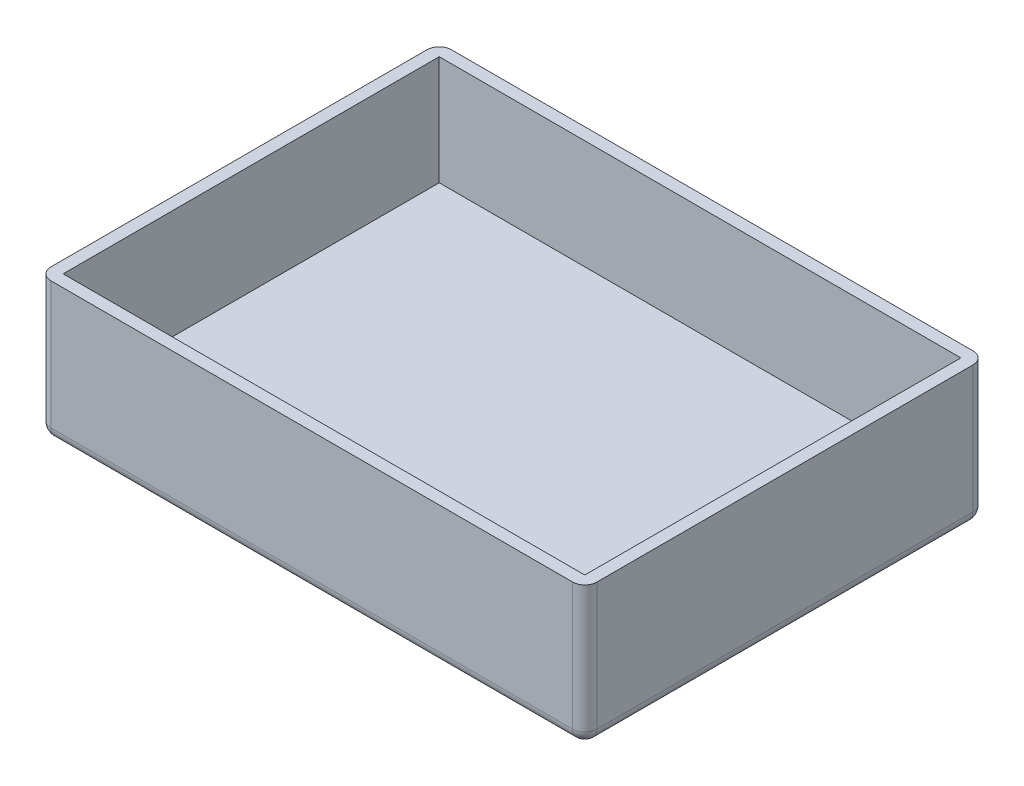
ISO-10303-21;
HEADER;
FILE_DESCRIPTION(('STEP AP214'),'2;1');
FILE_NAME('part.step','',(''),(''),'','','');
FILE_SCHEMA(('AUTOMOTIVE_DESIGN { 1 0 10303 214 1 1 1 1 }'));
ENDSEC;
DATA;
#1=APPLICATION_CONTEXT('core data for automotive mechanical design processes');
#2=APPLICATION_PROTOCOL_DEFINITION('international standard','automotive_design',2000,#1);
#3=PRODUCT_CONTEXT('',#1,'mechanical');
#4=PRODUCT('Part','Part','',(#3));
#5=PRODUCT_RELATED_PRODUCT_CATEGORY('part','',(#4));
#6=PRODUCT_DEFINITION_FORMATION('','',#4);
#7=PRODUCT_DEFINITION_CONTEXT('part definition',#1,'design');
#8=PRODUCT_DEFINITION('design','',#6,#7);
#9=PRODUCT_DEFINITION_SHAPE('','',#8);
#10=(LENGTH_UNIT() NAMED_UNIT(*) SI_UNIT(.MILLI.,.METRE.));
#11=(NAMED_UNIT(*) PLANE_ANGLE_UNIT() SI_UNIT($,.RADIAN.));
#12=(NAMED_UNIT(*) SI_UNIT($,.STERADIAN.) SOLID_ANGLE_UNIT());
#13=UNCERTAINTY_MEASURE_WITH_UNIT(LENGTH_MEASURE(1.E-05),#10,'distance_accuracy_value','');
#14=(GEOMETRIC_REPRESENTATION_CONTEXT(3) GLOBAL_UNCERTAINTY_ASSIGNED_CONTEXT((#13)) GLOBAL_UNIT_ASSIGNED_CONTEXT((#10,
#11,#12)) REPRESENTATION_CONTEXT('',''));
#15=CARTESIAN_POINT('',(0.,0.,0.));
#16=DIRECTION('',(0.,0.,1.));
#17=DIRECTION('',(1.,0.,0.));
#18=AXIS2_PLACEMENT_3D('',#15,#16,#17);
#19=CARTESIAN_POINT('',(-62.8276420970337,115.,33.434414562862));
#20=DIRECTION('',(1.,0.,0.));
#21=DIRECTION('',(0.,0.,-1.));
#22=AXIS2_PLACEMENT_3D('',#19,#20,#21);
#23=PLANE('',#22);
#24=DIRECTION('',(0.,0.,1.));
#25=VECTOR('',#24,1.);
#26=CARTESIAN_POINT('',(-62.8276420970337,9.99999999999999,33.434414562862));
#27=LINE('',#26,#25);
#28=CARTESIAN_POINT('',(-62.8276420970337,9.99999999999999,-286.565585437138));
#29=VERTEX_POINT('',#28);
#30=CARTESIAN_POINT('',(-62.8276420970337,9.99999999999999,23.434414562862));
#31=VERTEX_POINT('',#30);
#32=EDGE_CURVE('E50',#29,#31,#27,.T.);
#33=ORIENTED_EDGE('',*,*,#32,.T.);
#34=DIRECTION('',(0.,-1.,0.));
#35=VECTOR('',#34,1.);
#36=CARTESIAN_POINT('',(-62.8276420970337,115.,23.434414562862));
#37=LINE('',#36,#35);
#38=CARTESIAN_POINT('',(-62.8276420970337,115.,23.434414562862));
#39=VERTEX_POINT('',#38);
#40=EDGE_CURVE('E219',#31,#39,#37,.F.);
#41=ORIENTED_EDGE('',*,*,#40,.T.);
#42=DIRECTION('',(0.,0.,1.));
#43=VECTOR('',#42,1.);
#44=CARTESIAN_POINT('',(-62.8276420970337,115.,33.434414562862));
#45=LINE('',#44,#43);
#46=CARTESIAN_POINT('',(-62.8276420970337,115.,-286.565585437138));
#47=VERTEX_POINT('',#46);
#48=EDGE_CURVE('E174',#47,#39,#45,.T.);
#49=ORIENTED_EDGE('',*,*,#48,.F.);
#50=DIRECTION('',(0.,-1.,0.));
#51=VECTOR('',#50,1.);
#52=CARTESIAN_POINT('',(-62.8276420970337,115.,-286.565585437138));
#53=LINE('',#52,#51);
#54=EDGE_CURVE('E55',#47,#29,#53,.T.);
#55=ORIENTED_EDGE('',*,*,#54,.T.);
#56=EDGE_LOOP('',(#33,#41,#49,#55));
#57=FACE_BOUND('',#56,.T.);
#58=ADVANCED_FACE('F33',(#57),#23,.F.);
#59=CARTESIAN_POINT('',(-62.8276420970337,115.,33.434414562862));
#60=DIRECTION('',(0.,0.,-1.));
#61=DIRECTION('',(-1.,0.,0.));
#62=AXIS2_PLACEMENT_3D('',#59,#60,#61);
#63=PLANE('',#62);
#64=DIRECTION('',(1.,0.,0.));
#65=VECTOR('',#64,1.);
#66=CARTESIAN_POINT('',(-62.8276420970337,115.,33.434414562862));
#67=LINE('',#66,#65);
#68=CARTESIAN_POINT('',(-52.8276420970337,115.,33.434414562862));
#69=VERTEX_POINT('',#68);
#70=CARTESIAN_POINT('',(377.172357902966,115.,33.434414562862));
#71=VERTEX_POINT('',#70);
#72=EDGE_CURVE('E180',#69,#71,#67,.T.);
#73=ORIENTED_EDGE('',*,*,#72,.F.);
#74=DIRECTION('',(0.,-1.,0.));
#75=VECTOR('',#74,1.);
#76=CARTESIAN_POINT('',(-52.8276420970337,115.,33.434414562862));
#77=LINE('',#76,#75);
#78=CARTESIAN_POINT('',(-52.8276420970337,9.99999999999999,33.434414562862));
#79=VERTEX_POINT('',#78);
#80=EDGE_CURVE('E194',#69,#79,#77,.T.);
#81=ORIENTED_EDGE('',*,*,#80,.T.);
#82=DIRECTION('',(1.,0.,0.));
#83=VECTOR('',#82,1.);
#84=CARTESIAN_POINT('',(387.172357902966,9.99999999999999,33.434414562862));
#85=LINE('',#84,#83);
#86=CARTESIAN_POINT('',(377.172357902966,9.99999999999999,33.434414562862));
#87=VERTEX_POINT('',#86);
#88=EDGE_CURVE('E191',#79,#87,#85,.T.);
#89=ORIENTED_EDGE('',*,*,#88,.T.);
#90=DIRECTION('',(0.,-1.,0.));
#91=VECTOR('',#90,1.);
#92=CARTESIAN_POINT('',(377.172357902966,115.,33.434414562862));
#93=LINE('',#92,#91);
#94=EDGE_CURVE('E189',#87,#71,#93,.F.);
#95=ORIENTED_EDGE('',*,*,#94,.T.);
#96=EDGE_LOOP('',(#73,#81,#89,#95));
#97=FACE_BOUND('',#96,.T.);
#98=ADVANCED_FACE('F316',(#97),#63,.F.);
#99=CARTESIAN_POINT('',(387.172357902966,115.,33.434414562862));
#100=DIRECTION('',(-1.,0.,0.));
#101=DIRECTION('',(0.,0.,1.));
#102=AXIS2_PLACEMENT_3D('',#99,#100,#101);
#103=PLANE('',#102);
#104=DIRECTION('',(0.,0.,-1.));
#105=VECTOR('',#104,1.);
#106=CARTESIAN_POINT('',(387.172357902966,9.99999999999999,-296.565585437138));
#107=LINE('',#106,#105);
#108=CARTESIAN_POINT('',(387.172357902966,9.99999999999999,23.434414562862));
#109=VERTEX_POINT('',#108);
#110=CARTESIAN_POINT('',(387.172357902966,9.99999999999999,-286.565585437138));
#111=VERTEX_POINT('',#110);
#112=EDGE_CURVE('E207',#109,#111,#107,.T.);
#113=ORIENTED_EDGE('',*,*,#112,.T.);
#114=DIRECTION('',(0.,-1.,0.));
#115=VECTOR('',#114,1.);
#116=CARTESIAN_POINT('',(387.172357902966,115.,-286.565585437138));
#117=LINE('',#116,#115);
#118=CARTESIAN_POINT('',(387.172357902966,115.,-286.565585437138));
#119=VERTEX_POINT('',#118);
#120=EDGE_CURVE('E209',#111,#119,#117,.F.);
#121=ORIENTED_EDGE('',*,*,#120,.T.);
#122=DIRECTION('',(0.,0.,-1.));
#123=VECTOR('',#122,1.);
#124=CARTESIAN_POINT('',(387.172357902966,115.,33.434414562862));
#125=LINE('',#124,#123);
#126=CARTESIAN_POINT('',(387.172357902966,115.,23.434414562862));
#127=VERTEX_POINT('',#126);
#128=EDGE_CURVE('E183',#127,#119,#125,.T.);
#129=ORIENTED_EDGE('',*,*,#128,.F.);
#130=DIRECTION('',(0.,-1.,0.));
#131=VECTOR('',#130,1.);
#132=CARTESIAN_POINT('',(387.172357902966,115.,23.434414562862));
#133=LINE('',#132,#131);
#134=EDGE_CURVE('E205',#127,#109,#133,.T.);
#135=ORIENTED_EDGE('',*,*,#134,.T.);
#136=EDGE_LOOP('',(#113,#121,#129,#135));
#137=FACE_BOUND('',#136,.T.);
#138=ADVANCED_FACE('F319',(#137),#103,.F.);
#139=CARTESIAN_POINT('',(-62.8276420970337,115.,-296.565585437138));
#140=DIRECTION('',(0.,0.,1.));
#141=DIRECTION('',(1.,0.,0.));
#142=AXIS2_PLACEMENT_3D('',#139,#140,#141);
#143=PLANE('',#142);
#144=DIRECTION('',(-1.,0.,0.));
#145=VECTOR('',#144,1.);
#146=CARTESIAN_POINT('',(-62.8276420970337,9.99999999999999,-296.565585437138));
#147=LINE('',#146,#145);
#148=CARTESIAN_POINT('',(377.172357902966,9.99999999999999,-296.565585437138));
#149=VERTEX_POINT('',#148);
#150=CARTESIAN_POINT('',(-52.8276420970337,9.99999999999999,-296.565585437138));
#151=VERTEX_POINT('',#150);
#152=EDGE_CURVE('E213',#149,#151,#147,.T.);
#153=ORIENTED_EDGE('',*,*,#152,.T.);
#154=DIRECTION('',(0.,-1.,0.));
#155=VECTOR('',#154,1.);
#156=CARTESIAN_POINT('',(-52.8276420970337,115.,-296.565585437138));
#157=LINE('',#156,#155);
#158=CARTESIAN_POINT('',(-52.8276420970337,115.,-296.565585437138));
#159=VERTEX_POINT('',#158);
#160=EDGE_CURVE('E215',#151,#159,#157,.F.);
#161=ORIENTED_EDGE('',*,*,#160,.T.);
#162=DIRECTION('',(-1.,0.,0.));
#163=VECTOR('',#162,1.);
#164=CARTESIAN_POINT('',(-62.8276420970337,115.,-296.565585437138));
#165=LINE('',#164,#163);
#166=CARTESIAN_POINT('',(377.172357902966,115.,-296.565585437138));
#167=VERTEX_POINT('',#166);
#168=EDGE_CURVE('E186',#167,#159,#165,.T.);
#169=ORIENTED_EDGE('',*,*,#168,.F.);
#170=DIRECTION('',(0.,-1.,0.));
#171=VECTOR('',#170,1.);
#172=CARTESIAN_POINT('',(377.172357902966,115.,-296.565585437138));
#173=LINE('',#172,#171);
#174=EDGE_CURVE('E211',#167,#149,#173,.T.);
#175=ORIENTED_EDGE('',*,*,#174,.T.);
#176=EDGE_LOOP('',(#153,#161,#169,#175));
#177=FACE_BOUND('',#176,.T.);
#178=ADVANCED_FACE('F284',(#177),#143,.F.);
#179=CARTESIAN_POINT('',(0.,115.,0.));
#180=DIRECTION('',(0.,-1.,0.));
#181=DIRECTION('',(0.,0.,-1.));
#182=AXIS2_PLACEMENT_3D('',#179,#180,#181);
#183=PLANE('',#182);
#184=DIRECTION('',(1.,0.,0.));
#185=VECTOR('',#184,1.);
#186=CARTESIAN_POINT('',(-52.8276420970337,115.,23.434414562862));
#187=LINE('',#186,#185);
#188=CARTESIAN_POINT('',(-52.8276420970337,115.,23.434414562862));
#189=VERTEX_POINT('',#188);
#190=CARTESIAN_POINT('',(377.172357902966,115.,23.434414562862));
#191=VERTEX_POINT('',#190);
#192=EDGE_CURVE('E168',#189,#191,#187,.T.);
#193=ORIENTED_EDGE('',*,*,#192,.F.);
#194=DIRECTION('',(0.,0.,1.));
#195=VECTOR('',#194,1.);
#196=CARTESIAN_POINT('',(-52.8276420970337,115.,-286.565585437138));
#197=LINE('',#196,#195);
#198=CARTESIAN_POINT('',(-52.8276420970337,115.,-286.565585437138));
#199=VERTEX_POINT('',#198);
#200=EDGE_CURVE('E142',#199,#189,#197,.T.);
#201=ORIENTED_EDGE('',*,*,#200,.F.);
#202=DIRECTION('',(-1.,0.,0.));
#203=VECTOR('',#202,1.);
#204=CARTESIAN_POINT('',(-52.8276420970337,115.,-286.565585437138));
#205=LINE('',#204,#203);
#206=CARTESIAN_POINT('',(377.172357902966,115.,-286.565585437138));
#207=VERTEX_POINT('',#206);
#208=EDGE_CURVE('E159',#207,#199,#205,.T.);
#209=ORIENTED_EDGE('',*,*,#208,.F.);
#210=DIRECTION('',(0.,0.,-1.));
#211=VECTOR('',#210,1.);
#212=CARTESIAN_POINT('',(377.172357902966,115.,-286.565585437138));
#213=LINE('',#212,#211);
#214=EDGE_CURVE('E162',#191,#207,#213,.T.);
#215=ORIENTED_EDGE('',*,*,#214,.F.);
#216=EDGE_LOOP('',(#193,#201,#209,#215));
#217=FACE_BOUND('',#216,.T.);
#218=ORIENTED_EDGE('',*,*,#48,.T.);
#219=CARTESIAN_POINT('',(-52.8276420970337,115.,23.434414562862));
#220=DIRECTION('',(0.,-1.,0.));
#221=DIRECTION('',(0.,0.,-1.));
#222=AXIS2_PLACEMENT_3D('',#219,#220,#221);
#223=CIRCLE('',#222,10.);
#224=EDGE_CURVE('E11',#39,#69,#223,.F.);
#225=ORIENTED_EDGE('',*,*,#224,.T.);
#226=ORIENTED_EDGE('',*,*,#72,.T.);
#227=CARTESIAN_POINT('',(377.172357902966,115.,23.434414562862));
#228=DIRECTION('',(0.,-1.,0.));
#229=DIRECTION('',(0.,0.,-1.));
#230=AXIS2_PLACEMENT_3D('',#227,#228,#229);
#231=CIRCLE('',#230,10.);
#232=EDGE_CURVE('E221',#71,#127,#231,.F.);
#233=ORIENTED_EDGE('',*,*,#232,.T.);
#234=ORIENTED_EDGE('',*,*,#128,.T.);
#235=CARTESIAN_POINT('',(377.172357902966,115.,-286.565585437138));
#236=DIRECTION('',(0.,-1.,0.));
#237=DIRECTION('',(0.,0.,-1.));
#238=AXIS2_PLACEMENT_3D('',#235,#236,#237);
#239=CIRCLE('',#238,10.);
#240=EDGE_CURVE('E223',#119,#167,#239,.F.);
#241=ORIENTED_EDGE('',*,*,#240,.T.);
#242=ORIENTED_EDGE('',*,*,#168,.T.);
#243=CARTESIAN_POINT('',(-52.8276420970337,115.,-286.565585437138));
#244=DIRECTION('',(0.,-1.,0.));
#245=DIRECTION('',(0.,0.,-1.));
#246=AXIS2_PLACEMENT_3D('',#243,#244,#245);
#247=CIRCLE('',#246,10.);
#248=EDGE_CURVE('E42',#159,#47,#247,.F.);
#249=ORIENTED_EDGE('',*,*,#248,.T.);
#250=EDGE_LOOP('',(#218,#225,#226,#233,#234,#241,#242,#249));
#251=FACE_BOUND('',#250,.T.);
#252=ADVANCED_FACE('F277',(#217,#251),#183,.F.);
#253=CARTESIAN_POINT('',(0.,0.,0.));
#254=DIRECTION('',(0.,-1.,0.));
#255=DIRECTION('',(0.,0.,-1.));
#256=AXIS2_PLACEMENT_3D('',#253,#254,#255);
#257=PLANE('',#256);
#258=DIRECTION('',(0.,0.,-1.));
#259=VECTOR('',#258,1.);
#260=CARTESIAN_POINT('',(377.172357902966,0.,33.434414562862));
#261=LINE('',#260,#259);
#262=CARTESIAN_POINT('',(377.172357902966,0.,-286.565585437138));
#263=VERTEX_POINT('',#262);
#264=CARTESIAN_POINT('',(377.172357902966,0.,23.434414562862));
#265=VERTEX_POINT('',#264);
#266=EDGE_CURVE('E200',#263,#265,#261,.F.);
#267=ORIENTED_EDGE('',*,*,#266,.T.);
#268=DIRECTION('',(1.,0.,0.));
#269=VECTOR('',#268,1.);
#270=CARTESIAN_POINT('',(-62.8276420970337,0.,23.434414562862));
#271=LINE('',#270,#269);
#272=CARTESIAN_POINT('',(-52.8276420970337,0.,23.434414562862));
#273=VERTEX_POINT('',#272);
#274=EDGE_CURVE('E202',#265,#273,#271,.F.);
#275=ORIENTED_EDGE('',*,*,#274,.T.);
#276=DIRECTION('',(0.,0.,1.));
#277=VECTOR('',#276,1.);
#278=CARTESIAN_POINT('',(-52.8276420970337,0.,-296.565585437138));
#279=LINE('',#278,#277);
#280=CARTESIAN_POINT('',(-52.8276420970337,0.,-286.565585437138));
#281=VERTEX_POINT('',#280);
#282=EDGE_CURVE('E196',#273,#281,#279,.F.);
#283=ORIENTED_EDGE('',*,*,#282,.T.);
#284=DIRECTION('',(-1.,0.,0.));
#285=VECTOR('',#284,1.);
#286=CARTESIAN_POINT('',(387.172357902966,0.,-286.565585437138));
#287=LINE('',#286,#285);
#288=EDGE_CURVE('E198',#281,#263,#287,.F.);
#289=ORIENTED_EDGE('',*,*,#288,.T.);
#290=EDGE_LOOP('',(#267,#275,#283,#289));
#291=FACE_BOUND('',#290,.T.);
#292=ADVANCED_FACE('F303',(#291),#257,.T.);
#293=CARTESIAN_POINT('',(-52.8276420970337,25.,-286.565585437138));
#294=DIRECTION('',(-1.,0.,0.));
#295=DIRECTION('',(0.,0.,1.));
#296=AXIS2_PLACEMENT_3D('',#293,#294,#295);
#297=PLANE('',#296);
#298=ORIENTED_EDGE('',*,*,#200,.T.);
#299=DIRECTION('',(0.,1.,0.));
#300=VECTOR('',#299,1.);
#301=CARTESIAN_POINT('',(-52.8276420970337,25.,23.434414562862));
#302=LINE('',#301,#300);
#303=CARTESIAN_POINT('',(-52.8276420970337,25.,23.434414562862));
#304=VERTEX_POINT('',#303);
#305=EDGE_CURVE('E135',#304,#189,#302,.T.);
#306=ORIENTED_EDGE('',*,*,#305,.F.);
#307=DIRECTION('',(0.,0.,1.));
#308=VECTOR('',#307,1.);
#309=CARTESIAN_POINT('',(-52.8276420970337,25.,-286.565585437138));
#310=LINE('',#309,#308);
#311=CARTESIAN_POINT('',(-52.8276420970337,25.,-286.565585437138));
#312=VERTEX_POINT('',#311);
#313=EDGE_CURVE('E139',#312,#304,#310,.T.);
#314=ORIENTED_EDGE('',*,*,#313,.F.);
#315=DIRECTION('',(0.,1.,0.));
#316=VECTOR('',#315,1.);
#317=CARTESIAN_POINT('',(-52.8276420970337,25.,-286.565585437138));
#318=LINE('',#317,#316);
#319=EDGE_CURVE('E172',#312,#199,#318,.T.);
#320=ORIENTED_EDGE('',*,*,#319,.T.);
#321=EDGE_LOOP('',(#298,#306,#314,#320));
#322=FACE_BOUND('',#321,.T.);
#323=ADVANCED_FACE('F137',(#322),#297,.F.);
#324=CARTESIAN_POINT('',(-52.8276420970337,25.,-286.565585437138));
#325=DIRECTION('',(0.,0.,-1.));
#326=DIRECTION('',(-1.,0.,0.));
#327=AXIS2_PLACEMENT_3D('',#324,#325,#326);
#328=PLANE('',#327);
#329=ORIENTED_EDGE('',*,*,#208,.T.);
#330=ORIENTED_EDGE('',*,*,#319,.F.);
#331=DIRECTION('',(-1.,0.,0.));
#332=VECTOR('',#331,1.);
#333=CARTESIAN_POINT('',(-52.8276420970337,25.,-286.565585437138));
#334=LINE('',#333,#332);
#335=CARTESIAN_POINT('',(377.172357902966,25.,-286.565585437138));
#336=VERTEX_POINT('',#335);
#337=EDGE_CURVE('E147',#336,#312,#334,.T.);
#338=ORIENTED_EDGE('',*,*,#337,.F.);
#339=DIRECTION('',(0.,1.,0.));
#340=VECTOR('',#339,1.);
#341=CARTESIAN_POINT('',(377.172357902966,25.,-286.565585437138));
#342=LINE('',#341,#340);
#343=EDGE_CURVE('E175',#336,#207,#342,.T.);
#344=ORIENTED_EDGE('',*,*,#343,.T.);
#345=EDGE_LOOP('',(#329,#330,#338,#344));
#346=FACE_BOUND('',#345,.T.);
#347=ADVANCED_FACE('F366',(#346),#328,.F.);
#348=CARTESIAN_POINT('',(377.172357902966,25.,-286.565585437138));
#349=DIRECTION('',(1.,0.,0.));
#350=DIRECTION('',(0.,0.,-1.));
#351=AXIS2_PLACEMENT_3D('',#348,#349,#350);
#352=PLANE('',#351);
#353=ORIENTED_EDGE('',*,*,#214,.T.);
#354=ORIENTED_EDGE('',*,*,#343,.F.);
#355=DIRECTION('',(0.,0.,-1.));
#356=VECTOR('',#355,1.);
#357=CARTESIAN_POINT('',(377.172357902966,25.,-286.565585437138));
#358=LINE('',#357,#356);
#359=CARTESIAN_POINT('',(377.172357902966,25.,23.434414562862));
#360=VERTEX_POINT('',#359);
#361=EDGE_CURVE('E155',#360,#336,#358,.T.);
#362=ORIENTED_EDGE('',*,*,#361,.F.);
#363=DIRECTION('',(0.,1.,0.));
#364=VECTOR('',#363,1.);
#365=CARTESIAN_POINT('',(377.172357902966,25.,23.434414562862));
#366=LINE('',#365,#364);
#367=EDGE_CURVE('E146',#360,#191,#366,.T.);
#368=ORIENTED_EDGE('',*,*,#367,.T.);
#369=EDGE_LOOP('',(#353,#354,#362,#368));
#370=FACE_BOUND('',#369,.T.);
#371=ADVANCED_FACE('F363',(#370),#352,.F.);
#372=CARTESIAN_POINT('',(-52.8276420970337,25.,23.434414562862));
#373=DIRECTION('',(0.,0.,1.));
#374=DIRECTION('',(1.,0.,0.));
#375=AXIS2_PLACEMENT_3D('',#372,#373,#374);
#376=PLANE('',#375);
#377=ORIENTED_EDGE('',*,*,#192,.T.);
#378=ORIENTED_EDGE('',*,*,#367,.F.);
#379=DIRECTION('',(1.,0.,0.));
#380=VECTOR('',#379,1.);
#381=CARTESIAN_POINT('',(-52.8276420970337,25.,23.434414562862));
#382=LINE('',#381,#380);
#383=EDGE_CURVE('E150',#304,#360,#382,.T.);
#384=ORIENTED_EDGE('',*,*,#383,.F.);
#385=ORIENTED_EDGE('',*,*,#305,.T.);
#386=EDGE_LOOP('',(#377,#378,#384,#385));
#387=FACE_BOUND('',#386,.T.);
#388=ADVANCED_FACE('F151',(#387),#376,.F.);
#389=CARTESIAN_POINT('',(0.,25.,0.));
#390=DIRECTION('',(0.,1.,0.));
#391=DIRECTION('',(0.,0.,1.));
#392=AXIS2_PLACEMENT_3D('',#389,#390,#391);
#393=PLANE('',#392);
#394=ORIENTED_EDGE('',*,*,#313,.T.);
#395=ORIENTED_EDGE('',*,*,#383,.T.);
#396=ORIENTED_EDGE('',*,*,#361,.T.);
#397=ORIENTED_EDGE('',*,*,#337,.T.);
#398=EDGE_LOOP('',(#394,#395,#396,#397));
#399=FACE_BOUND('',#398,.T.);
#400=ADVANCED_FACE('F157',(#399),#393,.T.);
#401=CARTESIAN_POINT('',(-52.8276420970337,115.,-286.565585437138));
#402=DIRECTION('',(0.,-1.,0.));
#403=DIRECTION('',(0.,0.,-1.));
#404=AXIS2_PLACEMENT_3D('',#401,#402,#403);
#405=CYLINDRICAL_SURFACE('',#404,10.);
#406=ORIENTED_EDGE('',*,*,#248,.F.);
#407=ORIENTED_EDGE('',*,*,#160,.F.);
#408=CARTESIAN_POINT('',(-52.8276420970337,9.99999999999999,-286.565585437138));
#409=DIRECTION('',(0.,-1.,0.));
#410=DIRECTION('',(0.,0.,-1.));
#411=AXIS2_PLACEMENT_3D('',#408,#409,#410);
#412=CIRCLE('',#411,10.);
#413=EDGE_CURVE('E253',#29,#151,#412,.T.);
#414=ORIENTED_EDGE('',*,*,#413,.F.);
#415=ORIENTED_EDGE('',*,*,#54,.F.);
#416=EDGE_LOOP('',(#406,#407,#414,#415));
#417=FACE_BOUND('',#416,.T.);
#418=ADVANCED_FACE('F35',(#417),#405,.T.);
#419=CARTESIAN_POINT('',(377.172357902966,115.,-286.565585437138));
#420=DIRECTION('',(0.,-1.,0.));
#421=DIRECTION('',(0.,0.,-1.));
#422=AXIS2_PLACEMENT_3D('',#419,#420,#421);
#423=CYLINDRICAL_SURFACE('',#422,10.);
#424=ORIENTED_EDGE('',*,*,#240,.F.);
#425=ORIENTED_EDGE('',*,*,#120,.F.);
#426=CARTESIAN_POINT('',(377.172357902966,9.99999999999999,-286.565585437138));
#427=DIRECTION('',(0.,-1.,0.));
#428=DIRECTION('',(0.,0.,-1.));
#429=AXIS2_PLACEMENT_3D('',#426,#427,#428);
#430=CIRCLE('',#429,10.);
#431=EDGE_CURVE('E251',#149,#111,#430,.T.);
#432=ORIENTED_EDGE('',*,*,#431,.F.);
#433=ORIENTED_EDGE('',*,*,#174,.F.);
#434=EDGE_LOOP('',(#424,#425,#432,#433));
#435=FACE_BOUND('',#434,.T.);
#436=ADVANCED_FACE('F293',(#435),#423,.T.);
#437=CARTESIAN_POINT('',(-62.8276420970337,9.99999999999999,-286.565585437138));
#438=DIRECTION('',(1.,0.,0.));
#439=DIRECTION('',(0.,0.,-1.));
#440=AXIS2_PLACEMENT_3D('',#437,#438,#439);
#441=CYLINDRICAL_SURFACE('',#440,10.);
#442=CARTESIAN_POINT('',(-52.8276420970337,9.99999999999999,-286.565585437138));
#443=DIRECTION('',(-1.,0.,0.));
#444=DIRECTION('',(0.,0.,1.));
#445=AXIS2_PLACEMENT_3D('',#442,#443,#444);
#446=CIRCLE('',#445,10.);
#447=EDGE_CURVE('E37',#151,#281,#446,.T.);
#448=ORIENTED_EDGE('',*,*,#447,.F.);
#449=ORIENTED_EDGE('',*,*,#152,.F.);
#450=CARTESIAN_POINT('',(377.172357902966,10.,-286.565585437138));
#451=DIRECTION('',(1.,0.,0.));
#452=DIRECTION('',(0.,0.,-1.));
#453=AXIS2_PLACEMENT_3D('',#450,#451,#452);
#454=CIRCLE('',#453,10.);
#455=EDGE_CURVE('E248',#263,#149,#454,.T.);
#456=ORIENTED_EDGE('',*,*,#455,.F.);
#457=ORIENTED_EDGE('',*,*,#288,.F.);
#458=EDGE_LOOP('',(#448,#449,#456,#457));
#459=FACE_BOUND('',#458,.T.);
#460=ADVANCED_FACE('F288',(#459),#441,.T.);
#461=CARTESIAN_POINT('',(-52.8276420970337,10.,-286.565585437138));
#462=DIRECTION('',(0.,0.,1.));
#463=DIRECTION('',(1.,0.,0.));
#464=AXIS2_PLACEMENT_3D('',#461,#462,#463);
#465=SPHERICAL_SURFACE('',#464,10.);
#466=ORIENTED_EDGE('',*,*,#413,.T.);
#467=ORIENTED_EDGE('',*,*,#447,.T.);
#468=CARTESIAN_POINT('',(-52.8276420970337,10.,-286.565585437138));
#469=DIRECTION('',(0.,0.,-1.));
#470=DIRECTION('',(-1.,0.,0.));
#471=AXIS2_PLACEMENT_3D('',#468,#469,#470);
#472=CIRCLE('',#471,10.);
#473=EDGE_CURVE('E245',#29,#281,#472,.F.);
#474=ORIENTED_EDGE('',*,*,#473,.F.);
#475=EDGE_LOOP('',(#466,#467,#474));
#476=FACE_BOUND('',#475,.T.);
#477=ADVANCED_FACE('F259',(#476),#465,.T.);
#478=CARTESIAN_POINT('',(377.172357902966,10.,-286.565585437138));
#479=DIRECTION('',(0.,0.,1.));
#480=DIRECTION('',(1.,0.,0.));
#481=AXIS2_PLACEMENT_3D('',#478,#479,#480);
#482=SPHERICAL_SURFACE('',#481,10.);
#483=ORIENTED_EDGE('',*,*,#455,.T.);
#484=ORIENTED_EDGE('',*,*,#431,.T.);
#485=CARTESIAN_POINT('',(377.172357902966,9.99999999999999,-286.565585437138));
#486=DIRECTION('',(0.,0.,-1.));
#487=DIRECTION('',(-1.,0.,0.));
#488=AXIS2_PLACEMENT_3D('',#485,#486,#487);
#489=CIRCLE('',#488,10.);
#490=EDGE_CURVE('E242',#263,#111,#489,.F.);
#491=ORIENTED_EDGE('',*,*,#490,.F.);
#492=EDGE_LOOP('',(#483,#484,#491));
#493=FACE_BOUND('',#492,.T.);
#494=ADVANCED_FACE('F295',(#493),#482,.T.);
#495=CARTESIAN_POINT('',(-52.8276420970337,9.99999999999999,33.434414562862));
#496=DIRECTION('',(0.,0.,-1.));
#497=DIRECTION('',(-1.,0.,0.));
#498=AXIS2_PLACEMENT_3D('',#495,#496,#497);
#499=CYLINDRICAL_SURFACE('',#498,10.);
#500=ORIENTED_EDGE('',*,*,#473,.T.);
#501=ORIENTED_EDGE('',*,*,#282,.F.);
#502=CARTESIAN_POINT('',(-52.8276420970337,9.99999999999999,23.434414562862));
#503=DIRECTION('',(0.,0.,1.));
#504=DIRECTION('',(1.,0.,0.));
#505=AXIS2_PLACEMENT_3D('',#502,#503,#504);
#506=CIRCLE('',#505,10.);
#507=EDGE_CURVE('E239',#31,#273,#506,.T.);
#508=ORIENTED_EDGE('',*,*,#507,.F.);
#509=ORIENTED_EDGE('',*,*,#32,.F.);
#510=EDGE_LOOP('',(#500,#501,#508,#509));
#511=FACE_BOUND('',#510,.T.);
#512=ADVANCED_FACE('F265',(#511),#499,.T.);
#513=CARTESIAN_POINT('',(-52.8276420970337,115.,23.434414562862));
#514=DIRECTION('',(0.,-1.,0.));
#515=DIRECTION('',(0.,0.,-1.));
#516=AXIS2_PLACEMENT_3D('',#513,#514,#515);
#517=CYLINDRICAL_SURFACE('',#516,10.);
#518=ORIENTED_EDGE('',*,*,#224,.F.);
#519=ORIENTED_EDGE('',*,*,#40,.F.);
#520=CARTESIAN_POINT('',(-52.8276420970337,9.99999999999999,23.434414562862));
#521=DIRECTION('',(0.,-1.,0.));
#522=DIRECTION('',(0.,0.,-1.));
#523=AXIS2_PLACEMENT_3D('',#520,#521,#522);
#524=CIRCLE('',#523,10.);
#525=EDGE_CURVE('E236',#79,#31,#524,.T.);
#526=ORIENTED_EDGE('',*,*,#525,.F.);
#527=ORIENTED_EDGE('',*,*,#80,.F.);
#528=EDGE_LOOP('',(#518,#519,#526,#527));
#529=FACE_BOUND('',#528,.T.);
#530=ADVANCED_FACE('F275',(#529),#517,.T.);
#531=CARTESIAN_POINT('',(377.172357902966,115.,23.434414562862));
#532=DIRECTION('',(0.,-1.,0.));
#533=DIRECTION('',(0.,0.,-1.));
#534=AXIS2_PLACEMENT_3D('',#531,#532,#533);
#535=CYLINDRICAL_SURFACE('',#534,10.);
#536=ORIENTED_EDGE('',*,*,#232,.F.);
#537=ORIENTED_EDGE('',*,*,#94,.F.);
#538=CARTESIAN_POINT('',(377.172357902966,9.99999999999999,23.434414562862));
#539=DIRECTION('',(0.,-1.,0.));
#540=DIRECTION('',(0.,0.,-1.));
#541=AXIS2_PLACEMENT_3D('',#538,#539,#540);
#542=CIRCLE('',#541,10.);
#543=EDGE_CURVE('E233',#109,#87,#542,.T.);
#544=ORIENTED_EDGE('',*,*,#543,.F.);
#545=ORIENTED_EDGE('',*,*,#134,.F.);
#546=EDGE_LOOP('',(#536,#537,#544,#545));
#547=FACE_BOUND('',#546,.T.);
#548=ADVANCED_FACE('F314',(#547),#535,.T.);
#549=CARTESIAN_POINT('',(377.172357902966,9.99999999999999,33.434414562862));
#550=DIRECTION('',(0.,0.,1.));
#551=DIRECTION('',(1.,0.,0.));
#552=AXIS2_PLACEMENT_3D('',#549,#550,#551);
#553=CYLINDRICAL_SURFACE('',#552,10.);
#554=ORIENTED_EDGE('',*,*,#490,.T.);
#555=ORIENTED_EDGE('',*,*,#112,.F.);
#556=CARTESIAN_POINT('',(377.172357902966,10.,23.434414562862));
#557=DIRECTION('',(0.,0.,1.));
#558=DIRECTION('',(1.,0.,0.));
#559=AXIS2_PLACEMENT_3D('',#556,#557,#558);
#560=CIRCLE('',#559,10.);
#561=EDGE_CURVE('E230',#265,#109,#560,.T.);
#562=ORIENTED_EDGE('',*,*,#561,.F.);
#563=ORIENTED_EDGE('',*,*,#266,.F.);
#564=EDGE_LOOP('',(#554,#555,#562,#563));
#565=FACE_BOUND('',#564,.T.);
#566=ADVANCED_FACE('F300',(#565),#553,.T.);
#567=CARTESIAN_POINT('',(-52.8276420970337,10.,23.434414562862));
#568=DIRECTION('',(0.,0.,1.));
#569=DIRECTION('',(1.,0.,0.));
#570=AXIS2_PLACEMENT_3D('',#567,#568,#569);
#571=SPHERICAL_SURFACE('',#570,10.);
#572=ORIENTED_EDGE('',*,*,#525,.T.);
#573=ORIENTED_EDGE('',*,*,#507,.T.);
#574=CARTESIAN_POINT('',(-52.8276420970337,10.,23.434414562862));
#575=DIRECTION('',(-1.,0.,0.));
#576=DIRECTION('',(0.,0.,1.));
#577=AXIS2_PLACEMENT_3D('',#574,#575,#576);
#578=CIRCLE('',#577,10.);
#579=EDGE_CURVE('E228',#79,#273,#578,.F.);
#580=ORIENTED_EDGE('',*,*,#579,.F.);
#581=EDGE_LOOP('',(#572,#573,#580));
#582=FACE_BOUND('',#581,.T.);
#583=ADVANCED_FACE('F270',(#582),#571,.T.);
#584=CARTESIAN_POINT('',(377.172357902966,10.,23.434414562862));
#585=DIRECTION('',(0.,0.,1.));
#586=DIRECTION('',(1.,0.,0.));
#587=AXIS2_PLACEMENT_3D('',#584,#585,#586);
#588=SPHERICAL_SURFACE('',#587,10.);
#589=ORIENTED_EDGE('',*,*,#561,.T.);
#590=ORIENTED_EDGE('',*,*,#543,.T.);
#591=CARTESIAN_POINT('',(377.172357902966,9.99999999999999,23.434414562862));
#592=DIRECTION('',(1.,0.,0.));
#593=DIRECTION('',(0.,0.,-1.));
#594=AXIS2_PLACEMENT_3D('',#591,#592,#593);
#595=CIRCLE('',#594,10.);
#596=EDGE_CURVE('E226',#265,#87,#595,.F.);
#597=ORIENTED_EDGE('',*,*,#596,.F.);
#598=EDGE_LOOP('',(#589,#590,#597));
#599=FACE_BOUND('',#598,.T.);
#600=ADVANCED_FACE('F308',(#599),#588,.T.);
#601=CARTESIAN_POINT('',(-62.8276420970337,9.99999999999999,23.434414562862));
#602=DIRECTION('',(-1.,0.,0.));
#603=DIRECTION('',(0.,0.,1.));
#604=AXIS2_PLACEMENT_3D('',#601,#602,#603);
#605=CYLINDRICAL_SURFACE('',#604,10.);
#606=ORIENTED_EDGE('',*,*,#579,.T.);
#607=ORIENTED_EDGE('',*,*,#274,.F.);
#608=ORIENTED_EDGE('',*,*,#596,.T.);
#609=ORIENTED_EDGE('',*,*,#88,.F.);
#610=EDGE_LOOP('',(#606,#607,#608,#609));
#611=FACE_BOUND('',#610,.T.);
#612=ADVANCED_FACE('F306',(#611),#605,.T.);
#613=CLOSED_SHELL('',(#58,#98,#138,#178,#252,#292,#323,#347,#371,#388,#400,#418,#436,#460,#477,
#494,#512,#530,#548,#566,#583,#600,#612));
#614=MANIFOLD_SOLID_BREP('B2',#613);
#615=ADVANCED_BREP_SHAPE_REPRESENTATION('',(#18,#614),#14);
#616=SHAPE_DEFINITION_REPRESENTATION(#9,#615);
ENDSEC;
END-ISO-10303-21;
